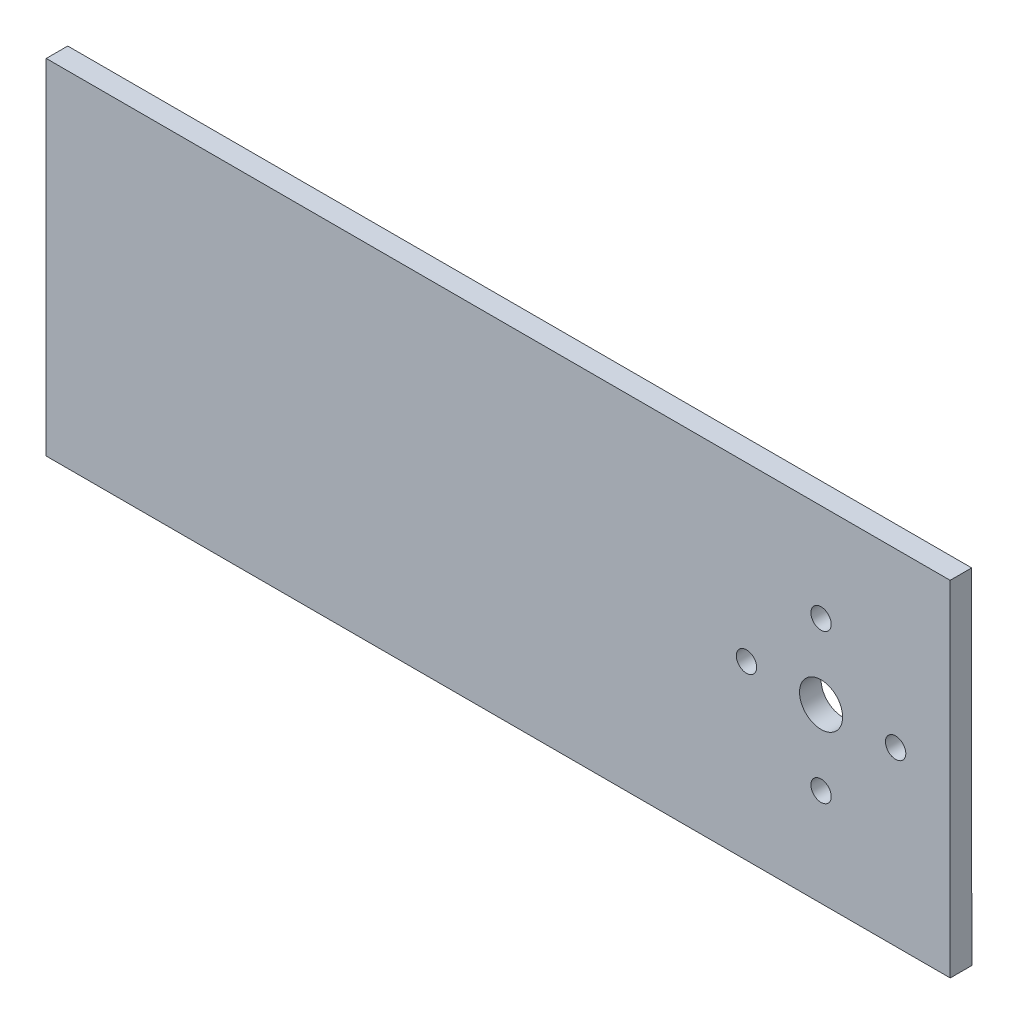
ISO-10303-21;
HEADER;
FILE_DESCRIPTION(('STEP AP214'),'2;1');
FILE_NAME('part.step','',(''),(''),'','','');
FILE_SCHEMA(('AUTOMOTIVE_DESIGN { 1 0 10303 214 1 1 1 1 }'));
ENDSEC;
DATA;
#1=APPLICATION_CONTEXT('core data for automotive mechanical design processes');
#2=APPLICATION_PROTOCOL_DEFINITION('international standard','automotive_design',2000,#1);
#3=PRODUCT_CONTEXT('',#1,'mechanical');
#4=PRODUCT('Part','Part','',(#3));
#5=PRODUCT_RELATED_PRODUCT_CATEGORY('part','',(#4));
#6=PRODUCT_DEFINITION_FORMATION('','',#4);
#7=PRODUCT_DEFINITION_CONTEXT('part definition',#1,'design');
#8=PRODUCT_DEFINITION('design','',#6,#7);
#9=PRODUCT_DEFINITION_SHAPE('','',#8);
#10=(LENGTH_UNIT() NAMED_UNIT(*) SI_UNIT(.MILLI.,.METRE.));
#11=(NAMED_UNIT(*) PLANE_ANGLE_UNIT() SI_UNIT($,.RADIAN.));
#12=(NAMED_UNIT(*) SI_UNIT($,.STERADIAN.) SOLID_ANGLE_UNIT());
#13=UNCERTAINTY_MEASURE_WITH_UNIT(LENGTH_MEASURE(1.E-05),#10,'distance_accuracy_value','');
#14=(GEOMETRIC_REPRESENTATION_CONTEXT(3) GLOBAL_UNCERTAINTY_ASSIGNED_CONTEXT((#13)) GLOBAL_UNIT_ASSIGNED_CONTEXT((#10,
#11,#12)) REPRESENTATION_CONTEXT('',''));
#15=CARTESIAN_POINT('',(0.,0.,0.));
#16=DIRECTION('',(0.,0.,1.));
#17=DIRECTION('',(1.,0.,0.));
#18=AXIS2_PLACEMENT_3D('',#15,#16,#17);
#19=CARTESIAN_POINT('',(0.,0.,53.975));
#20=DIRECTION('',(0.,0.,1.));
#21=DIRECTION('',(1.,0.,0.));
#22=AXIS2_PLACEMENT_3D('',#19,#20,#21);
#23=PLANE('',#22);
#24=CARTESIAN_POINT('',(101.6,-11.,53.975));
#25=DIRECTION('',(0.,0.,1.));
#26=DIRECTION('',(1.,0.,0.));
#27=AXIS2_PLACEMENT_3D('',#24,#25,#26);
#28=CIRCLE('',#27,1.5);
#29=CARTESIAN_POINT('',(103.1,-11.,53.975));
#30=VERTEX_POINT('',#29);
#31=EDGE_CURVE('E150',#30,#30,#28,.T.);
#32=ORIENTED_EDGE('',*,*,#31,.F.);
#33=EDGE_LOOP('',(#32));
#34=FACE_BOUND('',#33,.T.);
#35=CARTESIAN_POINT('',(101.6,11.,53.975));
#36=DIRECTION('',(0.,0.,1.));
#37=DIRECTION('',(1.,0.,0.));
#38=AXIS2_PLACEMENT_3D('',#35,#36,#37);
#39=CIRCLE('',#38,1.5);
#40=CARTESIAN_POINT('',(103.1,11.,53.975));
#41=VERTEX_POINT('',#40);
#42=EDGE_CURVE('E134',#41,#41,#39,.T.);
#43=ORIENTED_EDGE('',*,*,#42,.F.);
#44=EDGE_LOOP('',(#43));
#45=FACE_BOUND('',#44,.T.);
#46=DIRECTION('',(0.,-1.,0.));
#47=VECTOR('',#46,1.);
#48=CARTESIAN_POINT('',(-12.7,25.4,53.975));
#49=LINE('',#48,#47);
#50=CARTESIAN_POINT('',(-12.7,25.4,53.975));
#51=VERTEX_POINT('',#50);
#52=CARTESIAN_POINT('',(-12.7,-25.4,53.975));
#53=VERTEX_POINT('',#52);
#54=EDGE_CURVE('E93',#51,#53,#49,.T.);
#55=ORIENTED_EDGE('',*,*,#54,.T.);
#56=DIRECTION('',(1.,0.,0.));
#57=VECTOR('',#56,1.);
#58=CARTESIAN_POINT('',(-12.7,-25.4,53.975));
#59=LINE('',#58,#57);
#60=CARTESIAN_POINT('',(120.657586649094,-25.4,53.975));
#61=VERTEX_POINT('',#60);
#62=EDGE_CURVE('E87',#53,#61,#59,.T.);
#63=ORIENTED_EDGE('',*,*,#62,.T.);
#64=DIRECTION('',(-0.000298653511164569,0.999999955403039,0.));
#65=VECTOR('',#64,1.);
#66=CARTESIAN_POINT('',(120.64241505005,25.4,53.975));
#67=LINE('',#66,#65);
#68=CARTESIAN_POINT('',(120.64241505005,25.4,53.975));
#69=VERTEX_POINT('',#68);
#70=EDGE_CURVE('E90',#61,#69,#67,.T.);
#71=ORIENTED_EDGE('',*,*,#70,.T.);
#72=DIRECTION('',(-1.,0.,0.));
#73=VECTOR('',#72,1.);
#74=CARTESIAN_POINT('',(0.,25.4,53.975));
#75=LINE('',#74,#73);
#76=EDGE_CURVE('E59',#69,#51,#75,.T.);
#77=ORIENTED_EDGE('',*,*,#76,.T.);
#78=EDGE_LOOP('',(#55,#63,#71,#77));
#79=FACE_BOUND('',#78,.T.);
#80=CARTESIAN_POINT('',(101.6,0.,53.975));
#81=DIRECTION('',(0.,0.,1.));
#82=DIRECTION('',(1.,0.,0.));
#83=AXIS2_PLACEMENT_3D('',#80,#81,#82);
#84=CIRCLE('',#83,3.175);
#85=CARTESIAN_POINT('',(104.775,0.,53.975));
#86=VERTEX_POINT('',#85);
#87=EDGE_CURVE('E115',#86,#86,#84,.T.);
#88=ORIENTED_EDGE('',*,*,#87,.F.);
#89=EDGE_LOOP('',(#88));
#90=FACE_BOUND('',#89,.T.);
#91=CARTESIAN_POINT('',(112.6,0.,53.975));
#92=DIRECTION('',(0.,0.,1.));
#93=DIRECTION('',(1.,0.,0.));
#94=AXIS2_PLACEMENT_3D('',#91,#92,#93);
#95=CIRCLE('',#94,1.5);
#96=CARTESIAN_POINT('',(114.1,0.,53.975));
#97=VERTEX_POINT('',#96);
#98=EDGE_CURVE('E142',#97,#97,#95,.T.);
#99=ORIENTED_EDGE('',*,*,#98,.F.);
#100=EDGE_LOOP('',(#99));
#101=FACE_BOUND('',#100,.T.);
#102=CARTESIAN_POINT('',(90.6,0.,53.975));
#103=DIRECTION('',(0.,0.,1.));
#104=DIRECTION('',(1.,0.,0.));
#105=AXIS2_PLACEMENT_3D('',#102,#103,#104);
#106=CIRCLE('',#105,1.5);
#107=CARTESIAN_POINT('',(92.1,0.,53.975));
#108=VERTEX_POINT('',#107);
#109=EDGE_CURVE('E158',#108,#108,#106,.T.);
#110=ORIENTED_EDGE('',*,*,#109,.F.);
#111=EDGE_LOOP('',(#110));
#112=FACE_BOUND('',#111,.T.);
#113=ADVANCED_FACE('F41',(#34,#45,#79,#90,#101,#112),#23,.T.);
#114=CARTESIAN_POINT('',(0.,0.,50.8));
#115=DIRECTION('',(0.,0.,1.));
#116=DIRECTION('',(1.,0.,0.));
#117=AXIS2_PLACEMENT_3D('',#114,#115,#116);
#118=PLANE('',#117);
#119=DIRECTION('',(0.,-1.,0.));
#120=VECTOR('',#119,1.);
#121=CARTESIAN_POINT('',(-12.7,25.4,50.8));
#122=LINE('',#121,#120);
#123=CARTESIAN_POINT('',(-12.7,25.4,50.8));
#124=VERTEX_POINT('',#123);
#125=CARTESIAN_POINT('',(-12.7,-25.4,50.8));
#126=VERTEX_POINT('',#125);
#127=EDGE_CURVE('E111',#124,#126,#122,.T.);
#128=ORIENTED_EDGE('',*,*,#127,.F.);
#129=DIRECTION('',(-1.,0.,0.));
#130=VECTOR('',#129,1.);
#131=CARTESIAN_POINT('',(0.,25.4,50.8));
#132=LINE('',#131,#130);
#133=CARTESIAN_POINT('',(120.64241505005,25.4,50.8));
#134=VERTEX_POINT('',#133);
#135=EDGE_CURVE('E76',#134,#124,#132,.T.);
#136=ORIENTED_EDGE('',*,*,#135,.F.);
#137=DIRECTION('',(-0.000298653511164569,0.999999955403039,0.));
#138=VECTOR('',#137,1.);
#139=CARTESIAN_POINT('',(120.64241505005,25.4,50.8));
#140=LINE('',#139,#138);
#141=CARTESIAN_POINT('',(120.657586649094,-25.4,50.8));
#142=VERTEX_POINT('',#141);
#143=EDGE_CURVE('E118',#142,#134,#140,.T.);
#144=ORIENTED_EDGE('',*,*,#143,.F.);
#145=DIRECTION('',(1.,0.,0.));
#146=VECTOR('',#145,1.);
#147=CARTESIAN_POINT('',(0.,-25.4,50.8));
#148=LINE('',#147,#146);
#149=EDGE_CURVE('E99',#126,#142,#148,.T.);
#150=ORIENTED_EDGE('',*,*,#149,.F.);
#151=EDGE_LOOP('',(#128,#136,#144,#150));
#152=FACE_BOUND('',#151,.T.);
#153=CARTESIAN_POINT('',(101.6,0.,50.8));
#154=DIRECTION('',(0.,0.,1.));
#155=DIRECTION('',(1.,0.,0.));
#156=AXIS2_PLACEMENT_3D('',#153,#154,#155);
#157=CIRCLE('',#156,3.175);
#158=CARTESIAN_POINT('',(104.775,0.,50.8));
#159=VERTEX_POINT('',#158);
#160=EDGE_CURVE('E130',#159,#159,#157,.T.);
#161=ORIENTED_EDGE('',*,*,#160,.T.);
#162=EDGE_LOOP('',(#161));
#163=FACE_BOUND('',#162,.T.);
#164=CARTESIAN_POINT('',(101.6,11.,50.8));
#165=DIRECTION('',(0.,0.,1.));
#166=DIRECTION('',(1.,0.,0.));
#167=AXIS2_PLACEMENT_3D('',#164,#165,#166);
#168=CIRCLE('',#167,1.5);
#169=CARTESIAN_POINT('',(103.1,11.,50.8));
#170=VERTEX_POINT('',#169);
#171=EDGE_CURVE('E138',#170,#170,#168,.T.);
#172=ORIENTED_EDGE('',*,*,#171,.T.);
#173=EDGE_LOOP('',(#172));
#174=FACE_BOUND('',#173,.T.);
#175=CARTESIAN_POINT('',(112.6,0.,50.8));
#176=DIRECTION('',(0.,0.,1.));
#177=DIRECTION('',(1.,0.,0.));
#178=AXIS2_PLACEMENT_3D('',#175,#176,#177);
#179=CIRCLE('',#178,1.5);
#180=CARTESIAN_POINT('',(114.1,0.,50.8));
#181=VERTEX_POINT('',#180);
#182=EDGE_CURVE('E146',#181,#181,#179,.T.);
#183=ORIENTED_EDGE('',*,*,#182,.T.);
#184=EDGE_LOOP('',(#183));
#185=FACE_BOUND('',#184,.T.);
#186=CARTESIAN_POINT('',(101.6,-11.,50.8));
#187=DIRECTION('',(0.,0.,1.));
#188=DIRECTION('',(1.,0.,0.));
#189=AXIS2_PLACEMENT_3D('',#186,#187,#188);
#190=CIRCLE('',#189,1.5);
#191=CARTESIAN_POINT('',(103.1,-11.,50.8));
#192=VERTEX_POINT('',#191);
#193=EDGE_CURVE('E154',#192,#192,#190,.T.);
#194=ORIENTED_EDGE('',*,*,#193,.T.);
#195=EDGE_LOOP('',(#194));
#196=FACE_BOUND('',#195,.T.);
#197=CARTESIAN_POINT('',(90.6,0.,50.8));
#198=DIRECTION('',(0.,0.,1.));
#199=DIRECTION('',(1.,0.,0.));
#200=AXIS2_PLACEMENT_3D('',#197,#198,#199);
#201=CIRCLE('',#200,1.5);
#202=CARTESIAN_POINT('',(92.1,0.,50.8));
#203=VERTEX_POINT('',#202);
#204=EDGE_CURVE('E162',#203,#203,#201,.T.);
#205=ORIENTED_EDGE('',*,*,#204,.T.);
#206=EDGE_LOOP('',(#205));
#207=FACE_BOUND('',#206,.T.);
#208=ADVANCED_FACE('F174',(#152,#163,#174,#185,#196,#207),#118,.F.);
#209=CARTESIAN_POINT('',(-12.7,25.4,53.975));
#210=DIRECTION('',(1.,0.,0.));
#211=DIRECTION('',(0.,0.,-1.));
#212=AXIS2_PLACEMENT_3D('',#209,#210,#211);
#213=PLANE('',#212);
#214=ORIENTED_EDGE('',*,*,#127,.T.);
#215=DIRECTION('',(0.,0.,-1.));
#216=VECTOR('',#215,1.);
#217=CARTESIAN_POINT('',(-12.7,-25.4,53.975));
#218=LINE('',#217,#216);
#219=EDGE_CURVE('E11',#53,#126,#218,.T.);
#220=ORIENTED_EDGE('',*,*,#219,.F.);
#221=ORIENTED_EDGE('',*,*,#54,.F.);
#222=DIRECTION('',(0.,0.,-1.));
#223=VECTOR('',#222,1.);
#224=CARTESIAN_POINT('',(-12.7,25.4,53.975));
#225=LINE('',#224,#223);
#226=EDGE_CURVE('E107',#51,#124,#225,.T.);
#227=ORIENTED_EDGE('',*,*,#226,.T.);
#228=EDGE_LOOP('',(#214,#220,#221,#227));
#229=FACE_BOUND('',#228,.T.);
#230=ADVANCED_FACE('F43',(#229),#213,.F.);
#231=CARTESIAN_POINT('',(0.,-25.4,53.975));
#232=DIRECTION('',(0.,1.,0.));
#233=DIRECTION('',(0.,0.,1.));
#234=AXIS2_PLACEMENT_3D('',#231,#232,#233);
#235=PLANE('',#234);
#236=ORIENTED_EDGE('',*,*,#149,.T.);
#237=DIRECTION('',(0.,0.,-1.));
#238=VECTOR('',#237,1.);
#239=CARTESIAN_POINT('',(120.657586649094,-25.4,53.975));
#240=LINE('',#239,#238);
#241=EDGE_CURVE('E51',#61,#142,#240,.T.);
#242=ORIENTED_EDGE('',*,*,#241,.F.);
#243=ORIENTED_EDGE('',*,*,#62,.F.);
#244=ORIENTED_EDGE('',*,*,#219,.T.);
#245=EDGE_LOOP('',(#236,#242,#243,#244));
#246=FACE_BOUND('',#245,.T.);
#247=ADVANCED_FACE('F98',(#246),#235,.F.);
#248=CARTESIAN_POINT('',(120.64241505005,25.4,53.975));
#249=DIRECTION('',(-0.999999955403039,-0.000298653511164569,0.));
#250=DIRECTION('',(0.000298653511164569,-0.999999955403039,0.));
#251=AXIS2_PLACEMENT_3D('',#248,#249,#250);
#252=PLANE('',#251);
#253=ORIENTED_EDGE('',*,*,#143,.T.);
#254=DIRECTION('',(0.,0.,-1.));
#255=VECTOR('',#254,1.);
#256=CARTESIAN_POINT('',(120.64241505005,25.4,53.975));
#257=LINE('',#256,#255);
#258=EDGE_CURVE('E102',#69,#134,#257,.T.);
#259=ORIENTED_EDGE('',*,*,#258,.F.);
#260=ORIENTED_EDGE('',*,*,#70,.F.);
#261=ORIENTED_EDGE('',*,*,#241,.T.);
#262=EDGE_LOOP('',(#253,#259,#260,#261));
#263=FACE_BOUND('',#262,.T.);
#264=ADVANCED_FACE('F103',(#263),#252,.F.);
#265=CARTESIAN_POINT('',(0.,25.4,53.975));
#266=DIRECTION('',(0.,-1.,0.));
#267=DIRECTION('',(0.,0.,-1.));
#268=AXIS2_PLACEMENT_3D('',#265,#266,#267);
#269=PLANE('',#268);
#270=ORIENTED_EDGE('',*,*,#135,.T.);
#271=ORIENTED_EDGE('',*,*,#226,.F.);
#272=ORIENTED_EDGE('',*,*,#76,.F.);
#273=ORIENTED_EDGE('',*,*,#258,.T.);
#274=EDGE_LOOP('',(#270,#271,#272,#273));
#275=FACE_BOUND('',#274,.T.);
#276=ADVANCED_FACE('F126',(#275),#269,.F.);
#277=CARTESIAN_POINT('',(101.6,0.,53.975));
#278=DIRECTION('',(0.,0.,-1.));
#279=DIRECTION('',(-1.,0.,0.));
#280=AXIS2_PLACEMENT_3D('',#277,#278,#279);
#281=CYLINDRICAL_SURFACE('',#280,3.175);
#282=ORIENTED_EDGE('',*,*,#87,.T.);
#283=EDGE_LOOP('',(#282));
#284=FACE_BOUND('',#283,.T.);
#285=ORIENTED_EDGE('',*,*,#160,.F.);
#286=EDGE_LOOP('',(#285));
#287=FACE_BOUND('',#286,.T.);
#288=ADVANCED_FACE('F184',(#284,#287),#281,.F.);
#289=CARTESIAN_POINT('',(101.6,11.,53.975));
#290=DIRECTION('',(0.,0.,-1.));
#291=DIRECTION('',(-1.,0.,0.));
#292=AXIS2_PLACEMENT_3D('',#289,#290,#291);
#293=CYLINDRICAL_SURFACE('',#292,1.5);
#294=ORIENTED_EDGE('',*,*,#42,.T.);
#295=EDGE_LOOP('',(#294));
#296=FACE_BOUND('',#295,.T.);
#297=ORIENTED_EDGE('',*,*,#171,.F.);
#298=EDGE_LOOP('',(#297));
#299=FACE_BOUND('',#298,.T.);
#300=ADVANCED_FACE('F236',(#296,#299),#293,.F.);
#301=CARTESIAN_POINT('',(112.6,0.,53.975));
#302=DIRECTION('',(0.,0.,-1.));
#303=DIRECTION('',(-1.,0.,0.));
#304=AXIS2_PLACEMENT_3D('',#301,#302,#303);
#305=CYLINDRICAL_SURFACE('',#304,1.5);
#306=ORIENTED_EDGE('',*,*,#98,.T.);
#307=EDGE_LOOP('',(#306));
#308=FACE_BOUND('',#307,.T.);
#309=ORIENTED_EDGE('',*,*,#182,.F.);
#310=EDGE_LOOP('',(#309));
#311=FACE_BOUND('',#310,.T.);
#312=ADVANCED_FACE('F244',(#308,#311),#305,.F.);
#313=CARTESIAN_POINT('',(101.6,-11.,53.975));
#314=DIRECTION('',(0.,0.,-1.));
#315=DIRECTION('',(-1.,0.,0.));
#316=AXIS2_PLACEMENT_3D('',#313,#314,#315);
#317=CYLINDRICAL_SURFACE('',#316,1.5);
#318=ORIENTED_EDGE('',*,*,#31,.T.);
#319=EDGE_LOOP('',(#318));
#320=FACE_BOUND('',#319,.T.);
#321=ORIENTED_EDGE('',*,*,#193,.F.);
#322=EDGE_LOOP('',(#321));
#323=FACE_BOUND('',#322,.T.);
#324=ADVANCED_FACE('F252',(#320,#323),#317,.F.);
#325=CARTESIAN_POINT('',(90.6,0.,53.975));
#326=DIRECTION('',(0.,0.,-1.));
#327=DIRECTION('',(-1.,0.,0.));
#328=AXIS2_PLACEMENT_3D('',#325,#326,#327);
#329=CYLINDRICAL_SURFACE('',#328,1.5);
#330=ORIENTED_EDGE('',*,*,#109,.T.);
#331=EDGE_LOOP('',(#330));
#332=FACE_BOUND('',#331,.T.);
#333=ORIENTED_EDGE('',*,*,#204,.F.);
#334=EDGE_LOOP('',(#333));
#335=FACE_BOUND('',#334,.T.);
#336=ADVANCED_FACE('F170',(#332,#335),#329,.F.);
#337=CLOSED_SHELL('',(#113,#208,#230,#247,#264,#276,#288,#300,#312,#324,#336));
#338=MANIFOLD_SOLID_BREP('B2',#337);
#339=ADVANCED_BREP_SHAPE_REPRESENTATION('',(#18,#338),#14);
#340=SHAPE_DEFINITION_REPRESENTATION(#9,#339);
ENDSEC;
END-ISO-10303-21;
